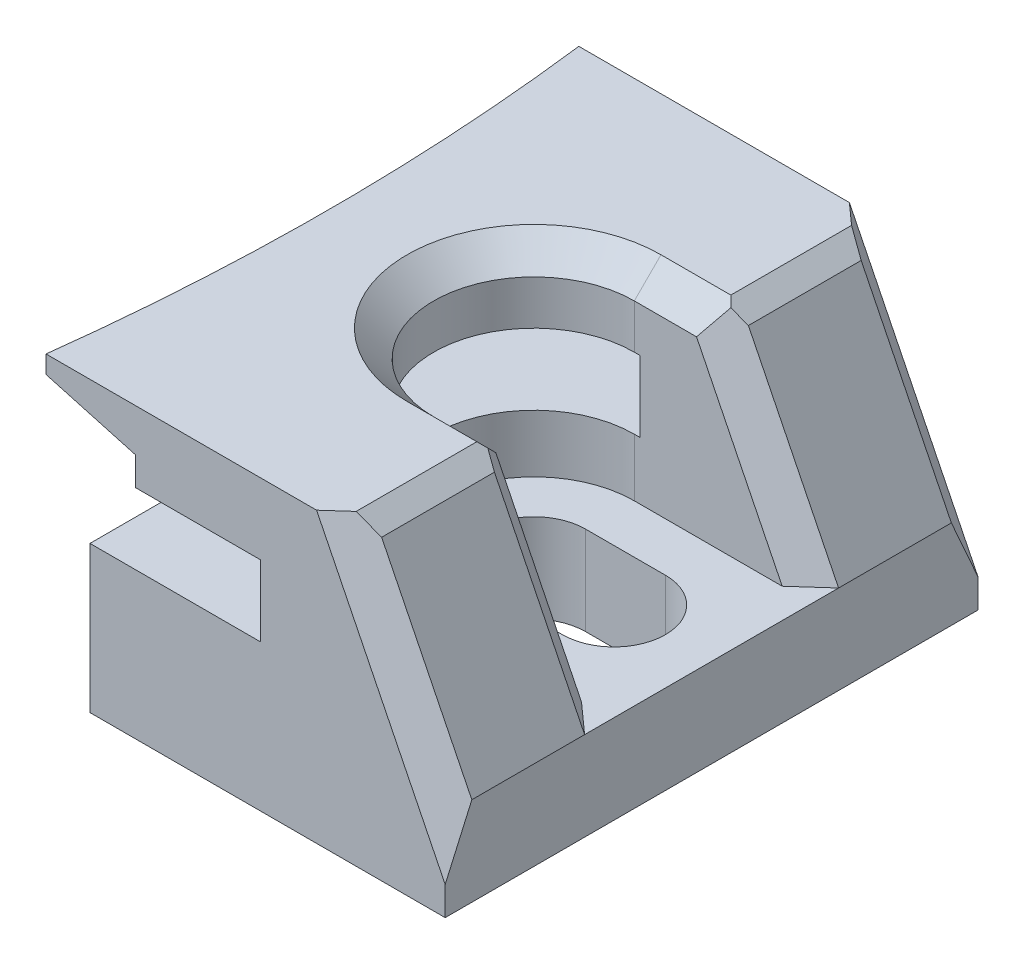
ISO-10303-21;
HEADER;
FILE_DESCRIPTION(('STEP AP214'),'2;1');
FILE_NAME('part.step','',(''),(''),'','','');
FILE_SCHEMA(('AUTOMOTIVE_DESIGN { 1 0 10303 214 1 1 1 1 }'));
ENDSEC;
DATA;
#1=APPLICATION_CONTEXT('core data for automotive mechanical design processes');
#2=APPLICATION_PROTOCOL_DEFINITION('international standard','automotive_design',2000,#1);
#3=PRODUCT_CONTEXT('',#1,'mechanical');
#4=PRODUCT('Part','Part','',(#3));
#5=PRODUCT_RELATED_PRODUCT_CATEGORY('part','',(#4));
#6=PRODUCT_DEFINITION_FORMATION('','',#4);
#7=PRODUCT_DEFINITION_CONTEXT('part definition',#1,'design');
#8=PRODUCT_DEFINITION('design','',#6,#7);
#9=PRODUCT_DEFINITION_SHAPE('','',#8);
#10=(LENGTH_UNIT() NAMED_UNIT(*) SI_UNIT(.MILLI.,.METRE.));
#11=(NAMED_UNIT(*) PLANE_ANGLE_UNIT() SI_UNIT($,.RADIAN.));
#12=(NAMED_UNIT(*) SI_UNIT($,.STERADIAN.) SOLID_ANGLE_UNIT());
#13=UNCERTAINTY_MEASURE_WITH_UNIT(LENGTH_MEASURE(1.E-05),#10,'distance_accuracy_value','');
#14=(GEOMETRIC_REPRESENTATION_CONTEXT(3) GLOBAL_UNCERTAINTY_ASSIGNED_CONTEXT((#13)) GLOBAL_UNIT_ASSIGNED_CONTEXT((#10,
#11,#12)) REPRESENTATION_CONTEXT('',''));
#15=CARTESIAN_POINT('',(0.,0.,0.));
#16=DIRECTION('',(0.,0.,1.));
#17=DIRECTION('',(1.,0.,0.));
#18=AXIS2_PLACEMENT_3D('',#15,#16,#17);
#19=CARTESIAN_POINT('',(0.,16.25,-15.));
#20=DIRECTION('',(0.,1.,0.));
#21=DIRECTION('',(0.,0.,1.));
#22=AXIS2_PLACEMENT_3D('',#19,#20,#21);
#23=PLANE('',#22);
#24=DIRECTION('',(0.74467699764755,0.,-0.667425028879371));
#25=VECTOR('',#24,1.);
#26=CARTESIAN_POINT('',(20.5941318379855,16.25,7.97782612680631));
#27=LINE('',#26,#25);
#28=CARTESIAN_POINT('',(12.7591674141475,16.25,15.));
#29=VERTEX_POINT('',#28);
#30=CARTESIAN_POINT('',(13.9327868442531,16.25,13.9481305525669));
#31=VERTEX_POINT('',#30);
#32=EDGE_CURVE('E508',#29,#31,#27,.T.);
#33=ORIENTED_EDGE('',*,*,#32,.T.);
#34=DIRECTION('',(0.,0.,-1.));
#35=VECTOR('',#34,1.);
#36=CARTESIAN_POINT('',(13.9327868442531,16.25,7.15));
#37=LINE('',#36,#35);
#38=CARTESIAN_POINT('',(13.9327868442531,16.25,7.14999999999998));
#39=VERTEX_POINT('',#38);
#40=EDGE_CURVE('E443',#31,#39,#37,.T.);
#41=ORIENTED_EDGE('',*,*,#40,.T.);
#42=DIRECTION('',(-1.,0.,0.));
#43=VECTOR('',#42,1.);
#44=CARTESIAN_POINT('',(0.,16.25,7.14999999999998));
#45=LINE('',#44,#43);
#46=CARTESIAN_POINT('',(10.,16.25,7.14999999999998));
#47=VERTEX_POINT('',#46);
#48=EDGE_CURVE('E467',#39,#47,#45,.T.);
#49=ORIENTED_EDGE('',*,*,#48,.T.);
#50=CARTESIAN_POINT('',(10.,16.25,0.));
#51=DIRECTION('',(0.,1.,0.));
#52=DIRECTION('',(0.,0.,1.));
#53=AXIS2_PLACEMENT_3D('',#50,#51,#52);
#54=CIRCLE('',#53,7.14999999999998);
#55=CARTESIAN_POINT('',(10.,16.25,-7.14999999999998));
#56=VERTEX_POINT('',#55);
#57=EDGE_CURVE('E466',#47,#56,#54,.F.);
#58=ORIENTED_EDGE('',*,*,#57,.T.);
#59=DIRECTION('',(1.,0.,0.));
#60=VECTOR('',#59,1.);
#61=CARTESIAN_POINT('',(0.,16.25,-7.14999999999998));
#62=LINE('',#61,#60);
#63=CARTESIAN_POINT('',(13.9327868442531,16.25,-7.14999999999998));
#64=VERTEX_POINT('',#63);
#65=EDGE_CURVE('E459',#56,#64,#62,.T.);
#66=ORIENTED_EDGE('',*,*,#65,.T.);
#67=DIRECTION('',(0.,0.,-1.));
#68=VECTOR('',#67,1.);
#69=CARTESIAN_POINT('',(13.9327868442531,16.25,-13.5));
#70=LINE('',#69,#68);
#71=CARTESIAN_POINT('',(13.9327868442531,16.25,-13.9481305525669));
#72=VERTEX_POINT('',#71);
#73=EDGE_CURVE('E451',#64,#72,#70,.T.);
#74=ORIENTED_EDGE('',*,*,#73,.T.);
#75=DIRECTION('',(0.744676997647548,0.,0.667425028879375));
#76=VECTOR('',#75,1.);
#77=CARTESIAN_POINT('',(5.68364983816396,16.25,-21.3415112020452));
#78=LINE('',#77,#76);
#79=CARTESIAN_POINT('',(12.7591674141475,16.25,-15.));
#80=VERTEX_POINT('',#79);
#81=EDGE_CURVE('E506',#72,#80,#78,.F.);
#82=ORIENTED_EDGE('',*,*,#81,.T.);
#83=DIRECTION('',(-1.,0.,0.));
#84=VECTOR('',#83,1.);
#85=CARTESIAN_POINT('',(0.,16.25,-15.));
#86=LINE('',#85,#84);
#87=CARTESIAN_POINT('',(-2.47564268186265,16.25,-15.));
#88=VERTEX_POINT('',#87);
#89=EDGE_CURVE('E544',#80,#88,#86,.T.);
#90=ORIENTED_EDGE('',*,*,#89,.T.);
#91=CARTESIAN_POINT('',(-123.55,16.25,0.));
#92=DIRECTION('',(0.,-1.,0.));
#93=DIRECTION('',(0.,0.,-1.));
#94=AXIS2_PLACEMENT_3D('',#91,#92,#93);
#95=CIRCLE('',#94,122.);
#96=CARTESIAN_POINT('',(-2.47564268186265,16.25,15.));
#97=VERTEX_POINT('',#96);
#98=EDGE_CURVE('E308',#88,#97,#95,.T.);
#99=ORIENTED_EDGE('',*,*,#98,.T.);
#100=DIRECTION('',(-1.,0.,0.));
#101=VECTOR('',#100,1.);
#102=CARTESIAN_POINT('',(0.,16.25,15.));
#103=LINE('',#102,#101);
#104=EDGE_CURVE('E537',#29,#97,#103,.T.);
#105=ORIENTED_EDGE('',*,*,#104,.F.);
#106=EDGE_LOOP('',(#33,#41,#49,#58,#66,#74,#82,#90,#99,#105));
#107=FACE_BOUND('',#106,.T.);
#108=ADVANCED_FACE('F34',(#107),#23,.T.);
#109=CARTESIAN_POINT('',(18.053258517141,8.93389673962023,-15.));
#110=DIRECTION('',(-0.896261105133883,-0.443526810265389,0.));
#111=DIRECTION('',(0.443526810265389,-0.896261105133883,0.));
#112=AXIS2_PLACEMENT_3D('',#109,#110,#111);
#113=PLANE('',#112);
#114=DIRECTION('',(-0.443526810265389,0.896261105133883,0.));
#115=VECTOR('',#114,1.);
#116=CARTESIAN_POINT('',(14.4327868442531,16.25,7.15));
#117=LINE('',#116,#115);
#118=CARTESIAN_POINT('',(20.,5.,7.15));
#119=VERTEX_POINT('',#118);
#120=CARTESIAN_POINT('',(14.9226180932799,15.2601687509732,7.15));
#121=VERTEX_POINT('',#120);
#122=EDGE_CURVE('E503',#119,#121,#117,.T.);
#123=ORIENTED_EDGE('',*,*,#122,.T.);
#124=DIRECTION('',(0.,0.,1.));
#125=VECTOR('',#124,1.);
#126=CARTESIAN_POINT('',(14.9226180932799,15.2601687509732,13.5));
#127=LINE('',#126,#125);
#128=CARTESIAN_POINT('',(14.9226180932799,15.2601687509732,13.5));
#129=VERTEX_POINT('',#128);
#130=EDGE_CURVE('E471',#121,#129,#127,.T.);
#131=ORIENTED_EDGE('',*,*,#130,.T.);
#132=DIRECTION('',(0.443526810265389,-0.896261105133883,0.));
#133=VECTOR('',#132,1.);
#134=CARTESIAN_POINT('',(20.,5.,13.5));
#135=LINE('',#134,#133);
#136=CARTESIAN_POINT('',(20.,5.,13.5));
#137=VERTEX_POINT('',#136);
#138=EDGE_CURVE('E501',#129,#137,#135,.T.);
#139=ORIENTED_EDGE('',*,*,#138,.T.);
#140=DIRECTION('',(0.,0.,1.));
#141=VECTOR('',#140,1.);
#142=CARTESIAN_POINT('',(20.,5.,-15.));
#143=LINE('',#142,#141);
#144=EDGE_CURVE('E558',#119,#137,#143,.T.);
#145=ORIENTED_EDGE('',*,*,#144,.F.);
#146=EDGE_LOOP('',(#123,#131,#139,#145));
#147=FACE_BOUND('',#146,.T.);
#148=ADVANCED_FACE('F391',(#147),#113,.F.);
#149=DIRECTION('',(-0.443526810265389,0.896261105133883,0.));
#150=VECTOR('',#149,1.);
#151=CARTESIAN_POINT('',(18.053258517141,8.93389673962023,-13.5));
#152=LINE('',#151,#150);
#153=CARTESIAN_POINT('',(20.,5.,-13.5));
#154=VERTEX_POINT('',#153);
#155=CARTESIAN_POINT('',(14.9226180932799,15.2601687509732,-13.5));
#156=VERTEX_POINT('',#155);
#157=EDGE_CURVE('E512',#154,#156,#152,.T.);
#158=ORIENTED_EDGE('',*,*,#157,.T.);
#159=DIRECTION('',(0.,0.,1.));
#160=VECTOR('',#159,1.);
#161=CARTESIAN_POINT('',(14.9226180932799,15.2601687509732,-7.15));
#162=LINE('',#161,#160);
#163=CARTESIAN_POINT('',(14.9226180932798,15.2601687509733,-7.14999999999999));
#164=VERTEX_POINT('',#163);
#165=EDGE_CURVE('E449',#156,#164,#162,.T.);
#166=ORIENTED_EDGE('',*,*,#165,.T.);
#167=DIRECTION('',(0.443526810265389,-0.896261105133883,0.));
#168=VECTOR('',#167,1.);
#169=CARTESIAN_POINT('',(20.,5.00000000000001,-7.15));
#170=LINE('',#169,#168);
#171=CARTESIAN_POINT('',(20.,5.,-7.15));
#172=VERTEX_POINT('',#171);
#173=EDGE_CURVE('E515',#164,#172,#170,.T.);
#174=ORIENTED_EDGE('',*,*,#173,.T.);
#175=EDGE_CURVE('E565',#154,#172,#143,.T.);
#176=ORIENTED_EDGE('',*,*,#175,.F.);
#177=EDGE_LOOP('',(#158,#166,#174,#176));
#178=FACE_BOUND('',#177,.T.);
#179=ADVANCED_FACE('F377',(#178),#113,.F.);
#180=CARTESIAN_POINT('',(-123.55,0.,0.));
#181=DIRECTION('',(0.,-1.,0.));
#182=DIRECTION('',(0.,0.,-1.));
#183=AXIS2_PLACEMENT_3D('',#180,#181,#182);
#184=CYLINDRICAL_SURFACE('',#183,134.);
#185=CARTESIAN_POINT('',(-123.55,12.25,0.));
#186=DIRECTION('',(0.,-1.,0.));
#187=DIRECTION('',(0.,0.,-1.));
#188=AXIS2_PLACEMENT_3D('',#185,#186,#187);
#189=CIRCLE('',#188,134.);
#190=CARTESIAN_POINT('',(10.330833206251,12.25,5.65));
#191=VERTEX_POINT('',#190);
#192=CARTESIAN_POINT('',(9.60780112332886,12.25,15.));
#193=VERTEX_POINT('',#192);
#194=EDGE_CURVE('E320',#191,#193,#189,.T.);
#195=ORIENTED_EDGE('',*,*,#194,.F.);
#196=DIRECTION('',(0.,-1.,0.));
#197=VECTOR('',#196,1.);
#198=CARTESIAN_POINT('',(10.330833206251,0.,5.65));
#199=LINE('',#198,#197);
#200=CARTESIAN_POINT('',(10.330833206251,8.25,5.65));
#201=VERTEX_POINT('',#200);
#202=EDGE_CURVE('E298',#191,#201,#199,.T.);
#203=ORIENTED_EDGE('',*,*,#202,.T.);
#204=CARTESIAN_POINT('',(-123.55,8.25,0.));
#205=DIRECTION('',(0.,-1.,0.));
#206=DIRECTION('',(0.,0.,-1.));
#207=AXIS2_PLACEMENT_3D('',#204,#205,#206);
#208=CIRCLE('',#207,134.);
#209=CARTESIAN_POINT('',(9.60780112332886,8.25,15.));
#210=VERTEX_POINT('',#209);
#211=EDGE_CURVE('E304',#201,#210,#208,.T.);
#212=ORIENTED_EDGE('',*,*,#211,.T.);
#213=DIRECTION('',(0.,-1.,0.));
#214=VECTOR('',#213,1.);
#215=CARTESIAN_POINT('',(9.60780112332886,0.,15.));
#216=LINE('',#215,#214);
#217=EDGE_CURVE('E571',#193,#210,#216,.T.);
#218=ORIENTED_EDGE('',*,*,#217,.F.);
#219=EDGE_LOOP('',(#195,#203,#212,#218));
#220=FACE_BOUND('',#219,.T.);
#221=ADVANCED_FACE('F374',(#220),#184,.F.);
#222=CARTESIAN_POINT('',(9.60780112332886,8.25,-15.));
#223=VERTEX_POINT('',#222);
#224=CARTESIAN_POINT('',(10.330833206251,8.25,-5.65));
#225=VERTEX_POINT('',#224);
#226=EDGE_CURVE('E305',#223,#225,#208,.T.);
#227=ORIENTED_EDGE('',*,*,#226,.T.);
#228=DIRECTION('',(0.,-1.,0.));
#229=VECTOR('',#228,1.);
#230=CARTESIAN_POINT('',(10.330833206251,0.,-5.65));
#231=LINE('',#230,#229);
#232=CARTESIAN_POINT('',(10.330833206251,12.25,-5.65));
#233=VERTEX_POINT('',#232);
#234=EDGE_CURVE('E292',#225,#233,#231,.F.);
#235=ORIENTED_EDGE('',*,*,#234,.T.);
#236=CARTESIAN_POINT('',(9.60780112332886,12.25,-15.));
#237=VERTEX_POINT('',#236);
#238=EDGE_CURVE('E321',#237,#233,#189,.T.);
#239=ORIENTED_EDGE('',*,*,#238,.F.);
#240=DIRECTION('',(0.,-1.,0.));
#241=VECTOR('',#240,1.);
#242=CARTESIAN_POINT('',(9.60780112332886,0.,-15.));
#243=LINE('',#242,#241);
#244=EDGE_CURVE('E583',#237,#223,#243,.T.);
#245=ORIENTED_EDGE('',*,*,#244,.T.);
#246=EDGE_LOOP('',(#227,#235,#239,#245));
#247=FACE_BOUND('',#246,.T.);
#248=ADVANCED_FACE('F376',(#247),#184,.F.);
#249=CARTESIAN_POINT('',(0.,12.25,0.));
#250=DIRECTION('',(0.,-1.,0.));
#251=DIRECTION('',(0.,0.,-1.));
#252=AXIS2_PLACEMENT_3D('',#249,#250,#251);
#253=PLANE('',#252);
#254=CARTESIAN_POINT('',(10.,12.25,0.));
#255=DIRECTION('',(0.,-1.,0.));
#256=DIRECTION('',(0.,0.,-1.));
#257=AXIS2_PLACEMENT_3D('',#254,#255,#256);
#258=CIRCLE('',#257,5.65);
#259=CARTESIAN_POINT('',(10.,12.25,5.65));
#260=VERTEX_POINT('',#259);
#261=CARTESIAN_POINT('',(10.,12.25,-5.65));
#262=VERTEX_POINT('',#261);
#263=EDGE_CURVE('E286',#260,#262,#258,.T.);
#264=ORIENTED_EDGE('',*,*,#263,.F.);
#265=DIRECTION('',(1.,0.,0.));
#266=VECTOR('',#265,1.);
#267=CARTESIAN_POINT('',(0.,12.25,5.65));
#268=LINE('',#267,#266);
#269=EDGE_CURVE('E301',#260,#191,#268,.T.);
#270=ORIENTED_EDGE('',*,*,#269,.T.);
#271=ORIENTED_EDGE('',*,*,#194,.T.);
#272=DIRECTION('',(1.,0.,0.));
#273=VECTOR('',#272,1.);
#274=CARTESIAN_POINT('',(0.,12.25,15.));
#275=LINE('',#274,#273);
#276=CARTESIAN_POINT('',(2.56106216347556,12.25,15.));
#277=VERTEX_POINT('',#276);
#278=EDGE_CURVE('E573',#277,#193,#275,.T.);
#279=ORIENTED_EDGE('',*,*,#278,.F.);
#280=CARTESIAN_POINT('',(-123.55,12.25,0.));
#281=DIRECTION('',(0.,-1.,0.));
#282=DIRECTION('',(0.,0.,-1.));
#283=AXIS2_PLACEMENT_3D('',#280,#281,#282);
#284=CIRCLE('',#283,127.);
#285=CARTESIAN_POINT('',(2.56106216347556,12.25,-15.));
#286=VERTEX_POINT('',#285);
#287=EDGE_CURVE('E317',#286,#277,#284,.T.);
#288=ORIENTED_EDGE('',*,*,#287,.F.);
#289=DIRECTION('',(1.,0.,0.));
#290=VECTOR('',#289,1.);
#291=CARTESIAN_POINT('',(0.,12.25,-15.));
#292=LINE('',#291,#290);
#293=EDGE_CURVE('E582',#286,#237,#292,.T.);
#294=ORIENTED_EDGE('',*,*,#293,.T.);
#295=ORIENTED_EDGE('',*,*,#238,.T.);
#296=DIRECTION('',(-1.,0.,0.));
#297=VECTOR('',#296,1.);
#298=CARTESIAN_POINT('',(0.,12.25,-5.65));
#299=LINE('',#298,#297);
#300=EDGE_CURVE('E295',#233,#262,#299,.T.);
#301=ORIENTED_EDGE('',*,*,#300,.T.);
#302=EDGE_LOOP('',(#264,#270,#271,#279,#288,#294,#295,#301));
#303=FACE_BOUND('',#302,.T.);
#304=ADVANCED_FACE('F379',(#303),#253,.T.);
#305=CARTESIAN_POINT('',(0.,8.25,0.));
#306=DIRECTION('',(0.,-1.,0.));
#307=DIRECTION('',(0.,0.,-1.));
#308=AXIS2_PLACEMENT_3D('',#305,#306,#307);
#309=PLANE('',#308);
#310=DIRECTION('',(1.,0.,0.));
#311=VECTOR('',#310,1.);
#312=CARTESIAN_POINT('',(0.,8.25,5.65));
#313=LINE('',#312,#311);
#314=CARTESIAN_POINT('',(10.,8.25,5.65));
#315=VERTEX_POINT('',#314);
#316=EDGE_CURVE('E524',#315,#201,#313,.T.);
#317=ORIENTED_EDGE('',*,*,#316,.F.);
#318=CARTESIAN_POINT('',(10.,8.25,0.));
#319=DIRECTION('',(0.,-1.,0.));
#320=DIRECTION('',(0.,0.,-1.));
#321=AXIS2_PLACEMENT_3D('',#318,#319,#320);
#322=CIRCLE('',#321,5.65);
#323=CARTESIAN_POINT('',(10.,8.25,-5.65));
#324=VERTEX_POINT('',#323);
#325=EDGE_CURVE('E528',#315,#324,#322,.T.);
#326=ORIENTED_EDGE('',*,*,#325,.T.);
#327=DIRECTION('',(-1.,0.,0.));
#328=VECTOR('',#327,1.);
#329=CARTESIAN_POINT('',(0.,8.25,-5.65));
#330=LINE('',#329,#328);
#331=EDGE_CURVE('E526',#225,#324,#330,.T.);
#332=ORIENTED_EDGE('',*,*,#331,.F.);
#333=ORIENTED_EDGE('',*,*,#226,.F.);
#334=DIRECTION('',(1.,0.,0.));
#335=VECTOR('',#334,1.);
#336=CARTESIAN_POINT('',(0.,8.25,-15.));
#337=LINE('',#336,#335);
#338=CARTESIAN_POINT('',(0.,8.25,-15.));
#339=VERTEX_POINT('',#338);
#340=EDGE_CURVE('E327',#339,#223,#337,.T.);
#341=ORIENTED_EDGE('',*,*,#340,.F.);
#342=DIRECTION('',(0.,0.,-1.));
#343=VECTOR('',#342,1.);
#344=CARTESIAN_POINT('',(0.,8.25,-15.));
#345=LINE('',#344,#343);
#346=CARTESIAN_POINT('',(0.,8.25,15.));
#347=VERTEX_POINT('',#346);
#348=EDGE_CURVE('E324',#347,#339,#345,.T.);
#349=ORIENTED_EDGE('',*,*,#348,.F.);
#350=DIRECTION('',(1.,0.,0.));
#351=VECTOR('',#350,1.);
#352=CARTESIAN_POINT('',(0.,8.25,15.));
#353=LINE('',#352,#351);
#354=EDGE_CURVE('E562',#347,#210,#353,.T.);
#355=ORIENTED_EDGE('',*,*,#354,.T.);
#356=ORIENTED_EDGE('',*,*,#211,.F.);
#357=EDGE_LOOP('',(#317,#326,#332,#333,#341,#349,#355,#356));
#358=FACE_BOUND('',#357,.T.);
#359=ADVANCED_FACE('F381',(#358),#309,.F.);
#360=CARTESIAN_POINT('',(0.,0.,-15.));
#361=DIRECTION('',(0.,0.,1.));
#362=DIRECTION('',(1.,0.,0.));
#363=AXIS2_PLACEMENT_3D('',#360,#361,#362);
#364=PLANE('',#363);
#365=ORIENTED_EDGE('',*,*,#89,.F.);
#366=DIRECTION('',(0.443526810265389,-0.896261105133883,0.));
#367=VECTOR('',#366,1.);
#368=CARTESIAN_POINT('',(16.7088668594402,8.26860652422214,-15.));
#369=LINE('',#368,#367);
#370=CARTESIAN_POINT('',(20.,1.61801729843013,-15.));
#371=VERTEX_POINT('',#370);
#372=EDGE_CURVE('E521',#80,#371,#369,.T.);
#373=ORIENTED_EDGE('',*,*,#372,.T.);
#374=DIRECTION('',(0.,-1.,0.));
#375=VECTOR('',#374,1.);
#376=CARTESIAN_POINT('',(20.,0.,-15.));
#377=LINE('',#376,#375);
#378=CARTESIAN_POINT('',(20.,0.,-15.));
#379=VERTEX_POINT('',#378);
#380=EDGE_CURVE('E548',#371,#379,#377,.T.);
#381=ORIENTED_EDGE('',*,*,#380,.T.);
#382=DIRECTION('',(-1.,0.,0.));
#383=VECTOR('',#382,1.);
#384=CARTESIAN_POINT('',(0.,0.,-15.));
#385=LINE('',#384,#383);
#386=CARTESIAN_POINT('',(0.,0.,-15.));
#387=VERTEX_POINT('',#386);
#388=EDGE_CURVE('E551',#379,#387,#385,.T.);
#389=ORIENTED_EDGE('',*,*,#388,.T.);
#390=DIRECTION('',(0.,1.,0.));
#391=VECTOR('',#390,1.);
#392=CARTESIAN_POINT('',(0.,0.,-15.));
#393=LINE('',#392,#391);
#394=EDGE_CURVE('E547',#387,#339,#393,.T.);
#395=ORIENTED_EDGE('',*,*,#394,.T.);
#396=ORIENTED_EDGE('',*,*,#340,.T.);
#397=ORIENTED_EDGE('',*,*,#244,.F.);
#398=ORIENTED_EDGE('',*,*,#293,.F.);
#399=DIRECTION('',(0.,-1.,0.));
#400=VECTOR('',#399,1.);
#401=CARTESIAN_POINT('',(2.56106216347558,0.,-15.));
#402=LINE('',#401,#400);
#403=CARTESIAN_POINT('',(2.56106216347558,13.85,-15.));
#404=VERTEX_POINT('',#403);
#405=EDGE_CURVE('E339',#404,#286,#402,.T.);
#406=ORIENTED_EDGE('',*,*,#405,.F.);
#407=CARTESIAN_POINT('',(-17.2503522939155,19.35122717024,-15.));
#408=CARTESIAN_POINT('',(-14.6728640274886,18.6366024557879,-15.));
#409=CARTESIAN_POINT('',(-12.0955023897701,17.9215212079282,-15.));
#410=CARTESIAN_POINT('',(-6.94099288870878,16.4905892491619,-15.));
#411=CARTESIAN_POINT('',(-4.36384502535253,15.7747385383033,-15.));
#412=CARTESIAN_POINT('',(0.79027667669653,14.3424111833684,-15.));
#413=CARTESIAN_POINT('',(3.36725051539305,13.6259345393053,-15.));
#414=CARTESIAN_POINT('',(8.52105158713077,12.1924535259276,-15.));
#415=CARTESIAN_POINT('',(11.0978788201628,11.4754491565803,-15.));
#416=CARTESIAN_POINT('',(13.674646272308,10.7582300807129,-15.));
#417=B_SPLINE_CURVE_WITH_KNOTS('',3,(#407,#408,#409,#410,#411,#412,#413,#414,#415,#416),
.UNSPECIFIED.,.F.,.F.,(4,2,2,2,4),(0.,8.0241639059122,16.0483273113437,24.0724905460078,
32.096654279301),.UNSPECIFIED.);
#418=CARTESIAN_POINT('',(-2.47564268186266,15.25,-15.));
#419=VERTEX_POINT('',#418);
#420=EDGE_CURVE('E332',#419,#404,#417,.T.);
#421=ORIENTED_EDGE('',*,*,#420,.F.);
#422=DIRECTION('',(0.,-1.,0.));
#423=VECTOR('',#422,1.);
#424=CARTESIAN_POINT('',(-2.47564268186265,0.,-15.));
#425=LINE('',#424,#423);
#426=EDGE_CURVE('E330',#88,#419,#425,.T.);
#427=ORIENTED_EDGE('',*,*,#426,.F.);
#428=EDGE_LOOP('',(#365,#373,#381,#389,#395,#396,#397,#398,#406,#421,#427));
#429=FACE_BOUND('',#428,.T.);
#430=ADVANCED_FACE('F341',(#429),#364,.F.);
#431=CARTESIAN_POINT('',(0.,0.,15.));
#432=DIRECTION('',(0.,0.,1.));
#433=DIRECTION('',(1.,0.,0.));
#434=AXIS2_PLACEMENT_3D('',#431,#432,#433);
#435=PLANE('',#434);
#436=DIRECTION('',(0.,-1.,0.));
#437=VECTOR('',#436,1.);
#438=CARTESIAN_POINT('',(20.,0.,15.));
#439=LINE('',#438,#437);
#440=CARTESIAN_POINT('',(20.,1.61801729843014,15.));
#441=VERTEX_POINT('',#440);
#442=CARTESIAN_POINT('',(20.,0.,15.));
#443=VERTEX_POINT('',#442);
#444=EDGE_CURVE('E585',#441,#443,#439,.T.);
#445=ORIENTED_EDGE('',*,*,#444,.F.);
#446=DIRECTION('',(-0.443526810265389,0.896261105133883,0.));
#447=VECTOR('',#446,1.);
#448=CARTESIAN_POINT('',(13.0883951865523,15.5847097846019,15.));
#449=LINE('',#448,#447);
#450=EDGE_CURVE('E499',#441,#29,#449,.T.);
#451=ORIENTED_EDGE('',*,*,#450,.T.);
#452=ORIENTED_EDGE('',*,*,#104,.T.);
#453=DIRECTION('',(0.,-1.,0.));
#454=VECTOR('',#453,1.);
#455=CARTESIAN_POINT('',(-2.47564268186265,0.,15.));
#456=LINE('',#455,#454);
#457=CARTESIAN_POINT('',(-2.47564268186266,15.25,15.));
#458=VERTEX_POINT('',#457);
#459=EDGE_CURVE('E364',#97,#458,#456,.T.);
#460=ORIENTED_EDGE('',*,*,#459,.T.);
#461=CARTESIAN_POINT('',(-17.2503522939155,19.35122717024,15.));
#462=CARTESIAN_POINT('',(-14.6728640274886,18.6366024557879,15.));
#463=CARTESIAN_POINT('',(-12.0955023897701,17.9215212079282,15.));
#464=CARTESIAN_POINT('',(-6.94099288870878,16.4905892491619,15.));
#465=CARTESIAN_POINT('',(-4.36384502535253,15.7747385383033,15.));
#466=CARTESIAN_POINT('',(0.79027667669653,14.3424111833684,15.));
#467=CARTESIAN_POINT('',(3.36725051539305,13.6259345393053,15.));
#468=CARTESIAN_POINT('',(8.52105158713077,12.1924535259276,15.));
#469=CARTESIAN_POINT('',(11.0978788201628,11.4754491565803,15.));
#470=CARTESIAN_POINT('',(13.674646272308,10.7582300807129,15.));
#471=B_SPLINE_CURVE_WITH_KNOTS('',3,(#461,#462,#463,#464,#465,#466,#467,#468,#469,#470),
.UNSPECIFIED.,.F.,.F.,(4,2,2,2,4),(0.,8.0241639059122,16.0483273113437,24.0724905460078,
32.096654279301),.UNSPECIFIED.);
#472=CARTESIAN_POINT('',(2.56106216347558,13.85,15.));
#473=VERTEX_POINT('',#472);
#474=EDGE_CURVE('E357',#458,#473,#471,.T.);
#475=ORIENTED_EDGE('',*,*,#474,.T.);
#476=DIRECTION('',(0.,-1.,0.));
#477=VECTOR('',#476,1.);
#478=CARTESIAN_POINT('',(2.56106216347558,0.,15.));
#479=LINE('',#478,#477);
#480=EDGE_CURVE('E365',#473,#277,#479,.T.);
#481=ORIENTED_EDGE('',*,*,#480,.T.);
#482=ORIENTED_EDGE('',*,*,#278,.T.);
#483=ORIENTED_EDGE('',*,*,#217,.T.);
#484=ORIENTED_EDGE('',*,*,#354,.F.);
#485=DIRECTION('',(0.,1.,0.));
#486=VECTOR('',#485,1.);
#487=CARTESIAN_POINT('',(0.,0.,15.));
#488=LINE('',#487,#486);
#489=CARTESIAN_POINT('',(0.,0.,15.));
#490=VERTEX_POINT('',#489);
#491=EDGE_CURVE('E590',#490,#347,#488,.T.);
#492=ORIENTED_EDGE('',*,*,#491,.F.);
#493=DIRECTION('',(-1.,0.,0.));
#494=VECTOR('',#493,1.);
#495=CARTESIAN_POINT('',(0.,0.,15.));
#496=LINE('',#495,#494);
#497=EDGE_CURVE('E553',#443,#490,#496,.T.);
#498=ORIENTED_EDGE('',*,*,#497,.F.);
#499=EDGE_LOOP('',(#445,#451,#452,#460,#475,#481,#482,#483,#484,#492,#498));
#500=FACE_BOUND('',#499,.T.);
#501=ADVANCED_FACE('F368',(#500),#435,.T.);
#502=CARTESIAN_POINT('',(20.,0.,-15.));
#503=DIRECTION('',(-1.,0.,0.));
#504=DIRECTION('',(0.,0.,1.));
#505=AXIS2_PLACEMENT_3D('',#502,#503,#504);
#506=PLANE('',#505);
#507=ORIENTED_EDGE('',*,*,#380,.F.);
#508=DIRECTION('',(0.,-0.914122598557605,-0.405437880329764));
#509=VECTOR('',#508,1.);
#510=CARTESIAN_POINT('',(20.,7.17538349989837,-12.5351590951861));
#511=LINE('',#510,#509);
#512=EDGE_CURVE('E517',#371,#154,#511,.F.);
#513=ORIENTED_EDGE('',*,*,#512,.T.);
#514=ORIENTED_EDGE('',*,*,#175,.T.);
#515=EDGE_CURVE('E568',#172,#119,#143,.T.);
#516=ORIENTED_EDGE('',*,*,#515,.T.);
#517=ORIENTED_EDGE('',*,*,#144,.T.);
#518=DIRECTION('',(0.,-0.914122598557606,0.405437880329761));
#519=VECTOR('',#518,1.);
#520=CARTESIAN_POINT('',(20.,8.28724328606058,12.0420194707673));
#521=LINE('',#520,#519);
#522=EDGE_CURVE('E519',#137,#441,#521,.T.);
#523=ORIENTED_EDGE('',*,*,#522,.T.);
#524=ORIENTED_EDGE('',*,*,#444,.T.);
#525=DIRECTION('',(0.,0.,1.));
#526=VECTOR('',#525,1.);
#527=CARTESIAN_POINT('',(20.,0.,-15.));
#528=LINE('',#527,#526);
#529=EDGE_CURVE('E559',#379,#443,#528,.T.);
#530=ORIENTED_EDGE('',*,*,#529,.F.);
#531=EDGE_LOOP('',(#507,#513,#514,#516,#517,#523,#524,#530));
#532=FACE_BOUND('',#531,.T.);
#533=ADVANCED_FACE('F372',(#532),#506,.F.);
#534=CARTESIAN_POINT('',(0.,0.,-15.));
#535=DIRECTION('',(0.,1.,0.));
#536=DIRECTION('',(-1.,0.,0.));
#537=AXIS2_PLACEMENT_3D('',#534,#535,#536);
#538=PLANE('',#537);
#539=DIRECTION('',(1.,0.,0.));
#540=VECTOR('',#539,1.);
#541=CARTESIAN_POINT('',(10.,0.,-2.9));
#542=LINE('',#541,#540);
#543=CARTESIAN_POINT('',(10.,0.,-2.9));
#544=VERTEX_POINT('',#543);
#545=CARTESIAN_POINT('',(14.5,0.,-2.9));
#546=VERTEX_POINT('',#545);
#547=EDGE_CURVE('E668',#544,#546,#542,.T.);
#548=ORIENTED_EDGE('',*,*,#547,.F.);
#549=CARTESIAN_POINT('',(10.,0.,0.));
#550=DIRECTION('',(0.,1.,0.));
#551=DIRECTION('',(-1.,0.,0.));
#552=AXIS2_PLACEMENT_3D('',#549,#550,#551);
#553=CIRCLE('',#552,2.9);
#554=CARTESIAN_POINT('',(10.,0.,2.9));
#555=VERTEX_POINT('',#554);
#556=EDGE_CURVE('E275',#555,#544,#553,.F.);
#557=ORIENTED_EDGE('',*,*,#556,.F.);
#558=DIRECTION('',(-1.,0.,0.));
#559=VECTOR('',#558,1.);
#560=CARTESIAN_POINT('',(10.,0.,2.9));
#561=LINE('',#560,#559);
#562=CARTESIAN_POINT('',(14.5,0.,2.9));
#563=VERTEX_POINT('',#562);
#564=EDGE_CURVE('E272',#563,#555,#561,.T.);
#565=ORIENTED_EDGE('',*,*,#564,.F.);
#566=CARTESIAN_POINT('',(14.5,0.,0.));
#567=DIRECTION('',(0.,1.,0.));
#568=DIRECTION('',(-1.,0.,0.));
#569=AXIS2_PLACEMENT_3D('',#566,#567,#568);
#570=CIRCLE('',#569,2.9);
#571=EDGE_CURVE('E245',#546,#563,#570,.F.);
#572=ORIENTED_EDGE('',*,*,#571,.F.);
#573=EDGE_LOOP('',(#548,#557,#565,#572));
#574=FACE_BOUND('',#573,.T.);
#575=ORIENTED_EDGE('',*,*,#529,.T.);
#576=ORIENTED_EDGE('',*,*,#497,.T.);
#577=DIRECTION('',(0.,0.,1.));
#578=VECTOR('',#577,1.);
#579=CARTESIAN_POINT('',(0.,0.,-15.));
#580=LINE('',#579,#578);
#581=EDGE_CURVE('E563',#387,#490,#580,.T.);
#582=ORIENTED_EDGE('',*,*,#581,.F.);
#583=ORIENTED_EDGE('',*,*,#388,.F.);
#584=EDGE_LOOP('',(#575,#576,#582,#583));
#585=FACE_BOUND('',#584,.T.);
#586=ADVANCED_FACE('F405',(#574,#585),#538,.F.);
#587=CARTESIAN_POINT('',(0.,0.,-15.));
#588=DIRECTION('',(1.,0.,0.));
#589=DIRECTION('',(0.,0.,-1.));
#590=AXIS2_PLACEMENT_3D('',#587,#588,#589);
#591=PLANE('',#590);
#592=ORIENTED_EDGE('',*,*,#491,.T.);
#593=ORIENTED_EDGE('',*,*,#348,.T.);
#594=ORIENTED_EDGE('',*,*,#394,.F.);
#595=ORIENTED_EDGE('',*,*,#581,.T.);
#596=EDGE_LOOP('',(#592,#593,#594,#595));
#597=FACE_BOUND('',#596,.T.);
#598=ADVANCED_FACE('F401',(#597),#591,.F.);
#599=CARTESIAN_POINT('',(-123.55,0.,0.));
#600=DIRECTION('',(0.,-1.,0.));
#601=DIRECTION('',(0.,0.,-1.));
#602=AXIS2_PLACEMENT_3D('',#599,#600,#601);
#603=CYLINDRICAL_SURFACE('',#602,127.);
#604=ORIENTED_EDGE('',*,*,#405,.T.);
#605=ORIENTED_EDGE('',*,*,#287,.T.);
#606=ORIENTED_EDGE('',*,*,#480,.F.);
#607=CARTESIAN_POINT('',(-123.55,13.85,0.));
#608=DIRECTION('',(0.,-1.,0.));
#609=DIRECTION('',(0.,0.,-1.));
#610=AXIS2_PLACEMENT_3D('',#607,#608,#609);
#611=CIRCLE('',#610,127.);
#612=EDGE_CURVE('E314',#404,#473,#611,.T.);
#613=ORIENTED_EDGE('',*,*,#612,.F.);
#614=EDGE_LOOP('',(#604,#605,#606,#613));
#615=FACE_BOUND('',#614,.T.);
#616=ADVANCED_FACE('F351',(#615),#603,.F.);
#617=CARTESIAN_POINT('',(-123.55,15.25,0.));
#618=DIRECTION('',(0.,-1.,0.));
#619=DIRECTION('',(0.,0.,-1.));
#620=AXIS2_PLACEMENT_3D('',#617,#618,#619);
#621=CONICAL_SURFACE('',#620,122.,1.29778762370819);
#622=ORIENTED_EDGE('',*,*,#420,.T.);
#623=ORIENTED_EDGE('',*,*,#612,.T.);
#624=ORIENTED_EDGE('',*,*,#474,.F.);
#625=CARTESIAN_POINT('',(-123.55,15.25,0.));
#626=DIRECTION('',(0.,-1.,0.));
#627=DIRECTION('',(0.,0.,-1.));
#628=AXIS2_PLACEMENT_3D('',#625,#626,#627);
#629=CIRCLE('',#628,122.);
#630=EDGE_CURVE('E311',#419,#458,#629,.T.);
#631=ORIENTED_EDGE('',*,*,#630,.F.);
#632=EDGE_LOOP('',(#622,#623,#624,#631));
#633=FACE_BOUND('',#632,.T.);
#634=ADVANCED_FACE('F345',(#633),#621,.F.);
#635=CARTESIAN_POINT('',(-123.55,0.,0.));
#636=DIRECTION('',(0.,-1.,0.));
#637=DIRECTION('',(0.,0.,-1.));
#638=AXIS2_PLACEMENT_3D('',#635,#636,#637);
#639=CYLINDRICAL_SURFACE('',#638,122.);
#640=ORIENTED_EDGE('',*,*,#426,.T.);
#641=ORIENTED_EDGE('',*,*,#630,.T.);
#642=ORIENTED_EDGE('',*,*,#459,.F.);
#643=ORIENTED_EDGE('',*,*,#98,.F.);
#644=EDGE_LOOP('',(#640,#641,#642,#643));
#645=FACE_BOUND('',#644,.T.);
#646=ADVANCED_FACE('F350',(#645),#639,.F.);
#647=CARTESIAN_POINT('',(0.,16.25,5.65));
#648=DIRECTION('',(0.,0.,-1.));
#649=DIRECTION('',(-1.,0.,0.));
#650=AXIS2_PLACEMENT_3D('',#647,#648,#649);
#651=PLANE('',#650);
#652=DIRECTION('',(0.,-1.,0.));
#653=VECTOR('',#652,1.);
#654=CARTESIAN_POINT('',(10.,16.25,5.65));
#655=LINE('',#654,#653);
#656=CARTESIAN_POINT('',(10.,14.75,5.65));
#657=VERTEX_POINT('',#656);
#658=EDGE_CURVE('E288',#657,#260,#655,.T.);
#659=ORIENTED_EDGE('',*,*,#658,.F.);
#660=DIRECTION('',(1.,0.,0.));
#661=VECTOR('',#660,1.);
#662=CARTESIAN_POINT('',(0.,14.75,5.65));
#663=LINE('',#662,#661);
#664=CARTESIAN_POINT('',(13.5014625015804,14.75,5.65));
#665=VERTEX_POINT('',#664);
#666=EDGE_CURVE('E494',#657,#665,#663,.T.);
#667=ORIENTED_EDGE('',*,*,#666,.T.);
#668=DIRECTION('',(0.443526810265389,-0.896261105133883,0.));
#669=VECTOR('',#668,1.);
#670=CARTESIAN_POINT('',(18.6556083422992,4.33470978460192,5.65));
#671=LINE('',#670,#669);
#672=CARTESIAN_POINT('',(18.3263805698944,5.00000000000001,5.65));
#673=VERTEX_POINT('',#672);
#674=EDGE_CURVE('E497',#665,#673,#671,.T.);
#675=ORIENTED_EDGE('',*,*,#674,.T.);
#676=DIRECTION('',(1.,0.,0.));
#677=VECTOR('',#676,1.);
#678=CARTESIAN_POINT('',(0.,5.,5.65));
#679=LINE('',#678,#677);
#680=CARTESIAN_POINT('',(10.,5.00000000000001,5.65));
#681=VERTEX_POINT('',#680);
#682=EDGE_CURVE('E274',#681,#673,#679,.T.);
#683=ORIENTED_EDGE('',*,*,#682,.F.);
#684=EDGE_CURVE('E283',#315,#681,#655,.T.);
#685=ORIENTED_EDGE('',*,*,#684,.F.);
#686=ORIENTED_EDGE('',*,*,#316,.T.);
#687=ORIENTED_EDGE('',*,*,#202,.F.);
#688=ORIENTED_EDGE('',*,*,#269,.F.);
#689=EDGE_LOOP('',(#659,#667,#675,#683,#685,#686,#687,#688));
#690=FACE_BOUND('',#689,.T.);
#691=ADVANCED_FACE('F637',(#690),#651,.T.);
#692=CARTESIAN_POINT('',(0.,16.25,-5.65));
#693=DIRECTION('',(0.,0.,1.));
#694=DIRECTION('',(1.,0.,0.));
#695=AXIS2_PLACEMENT_3D('',#692,#693,#694);
#696=PLANE('',#695);
#697=DIRECTION('',(-0.443526810265389,0.896261105133883,0.));
#698=VECTOR('',#697,1.);
#699=CARTESIAN_POINT('',(13.0883951865523,15.5847097846019,-5.65));
#700=LINE('',#699,#698);
#701=CARTESIAN_POINT('',(18.3263805698944,5.00000000000001,-5.65));
#702=VERTEX_POINT('',#701);
#703=CARTESIAN_POINT('',(13.5014625015804,14.75,-5.65));
#704=VERTEX_POINT('',#703);
#705=EDGE_CURVE('E492',#702,#704,#700,.T.);
#706=ORIENTED_EDGE('',*,*,#705,.T.);
#707=DIRECTION('',(-1.,0.,0.));
#708=VECTOR('',#707,1.);
#709=CARTESIAN_POINT('',(0.,14.75,-5.65));
#710=LINE('',#709,#708);
#711=CARTESIAN_POINT('',(10.,14.75,-5.65));
#712=VERTEX_POINT('',#711);
#713=EDGE_CURVE('E490',#704,#712,#710,.T.);
#714=ORIENTED_EDGE('',*,*,#713,.T.);
#715=DIRECTION('',(0.,-1.,0.));
#716=VECTOR('',#715,1.);
#717=CARTESIAN_POINT('',(10.,16.25,-5.65));
#718=LINE('',#717,#716);
#719=EDGE_CURVE('E284',#712,#262,#718,.T.);
#720=ORIENTED_EDGE('',*,*,#719,.T.);
#721=ORIENTED_EDGE('',*,*,#300,.F.);
#722=ORIENTED_EDGE('',*,*,#234,.F.);
#723=ORIENTED_EDGE('',*,*,#331,.T.);
#724=CARTESIAN_POINT('',(10.,5.00000000000001,-5.65));
#725=VERTEX_POINT('',#724);
#726=EDGE_CURVE('E287',#324,#725,#718,.T.);
#727=ORIENTED_EDGE('',*,*,#726,.T.);
#728=DIRECTION('',(-1.,0.,0.));
#729=VECTOR('',#728,1.);
#730=CARTESIAN_POINT('',(0.,5.,-5.65));
#731=LINE('',#730,#729);
#732=EDGE_CURVE('E281',#702,#725,#731,.T.);
#733=ORIENTED_EDGE('',*,*,#732,.F.);
#734=EDGE_LOOP('',(#706,#714,#720,#721,#722,#723,#727,#733));
#735=FACE_BOUND('',#734,.T.);
#736=ADVANCED_FACE('F613',(#735),#696,.T.);
#737=CARTESIAN_POINT('',(10.,16.25,0.));
#738=DIRECTION('',(0.,-1.,0.));
#739=DIRECTION('',(1.,0.,0.));
#740=AXIS2_PLACEMENT_3D('',#737,#738,#739);
#741=CYLINDRICAL_SURFACE('',#740,5.65);
#742=ORIENTED_EDGE('',*,*,#684,.T.);
#743=CARTESIAN_POINT('',(10.,5.00000000000001,0.));
#744=DIRECTION('',(0.,-1.,0.));
#745=DIRECTION('',(1.,0.,0.));
#746=AXIS2_PLACEMENT_3D('',#743,#744,#745);
#747=CIRCLE('',#746,5.65);
#748=EDGE_CURVE('E278',#681,#725,#747,.T.);
#749=ORIENTED_EDGE('',*,*,#748,.T.);
#750=ORIENTED_EDGE('',*,*,#726,.F.);
#751=ORIENTED_EDGE('',*,*,#325,.F.);
#752=EDGE_LOOP('',(#742,#749,#750,#751));
#753=FACE_BOUND('',#752,.T.);
#754=ADVANCED_FACE('F624',(#753),#741,.F.);
#755=ORIENTED_EDGE('',*,*,#719,.F.);
#756=CARTESIAN_POINT('',(10.,14.75,0.));
#757=DIRECTION('',(0.,1.,0.));
#758=DIRECTION('',(0.,0.,1.));
#759=AXIS2_PLACEMENT_3D('',#756,#757,#758);
#760=CIRCLE('',#759,5.65);
#761=EDGE_CURVE('E488',#712,#657,#760,.T.);
#762=ORIENTED_EDGE('',*,*,#761,.T.);
#763=ORIENTED_EDGE('',*,*,#658,.T.);
#764=ORIENTED_EDGE('',*,*,#263,.T.);
#765=EDGE_LOOP('',(#755,#762,#763,#764));
#766=FACE_BOUND('',#765,.T.);
#767=ADVANCED_FACE('F617',(#766),#741,.F.);
#768=CARTESIAN_POINT('',(0.,5.,0.));
#769=DIRECTION('',(0.,-1.,0.));
#770=DIRECTION('',(1.,0.,0.));
#771=AXIS2_PLACEMENT_3D('',#768,#769,#770);
#772=PLANE('',#771);
#773=DIRECTION('',(1.,0.,0.));
#774=VECTOR('',#773,1.);
#775=CARTESIAN_POINT('',(10.,5.00000000000001,2.9));
#776=LINE('',#775,#774);
#777=CARTESIAN_POINT('',(10.,5.00000000000001,2.9));
#778=VERTEX_POINT('',#777);
#779=CARTESIAN_POINT('',(14.5,5.00000000000001,2.9));
#780=VERTEX_POINT('',#779);
#781=EDGE_CURVE('E253',#778,#780,#776,.T.);
#782=ORIENTED_EDGE('',*,*,#781,.F.);
#783=CARTESIAN_POINT('',(10.,5.00000000000001,0.));
#784=DIRECTION('',(0.,1.,0.));
#785=DIRECTION('',(-1.,0.,0.));
#786=AXIS2_PLACEMENT_3D('',#783,#784,#785);
#787=CIRCLE('',#786,2.9);
#788=CARTESIAN_POINT('',(10.,5.00000000000001,-2.9));
#789=VERTEX_POINT('',#788);
#790=EDGE_CURVE('E258',#789,#778,#787,.T.);
#791=ORIENTED_EDGE('',*,*,#790,.F.);
#792=DIRECTION('',(-1.,0.,0.));
#793=VECTOR('',#792,1.);
#794=CARTESIAN_POINT('',(10.,5.00000000000001,-2.9));
#795=LINE('',#794,#793);
#796=CARTESIAN_POINT('',(14.5,5.00000000000001,-2.9));
#797=VERTEX_POINT('',#796);
#798=EDGE_CURVE('E263',#797,#789,#795,.T.);
#799=ORIENTED_EDGE('',*,*,#798,.F.);
#800=CARTESIAN_POINT('',(14.5,5.00000000000001,0.));
#801=DIRECTION('',(0.,1.,0.));
#802=DIRECTION('',(-1.,0.,0.));
#803=AXIS2_PLACEMENT_3D('',#800,#801,#802);
#804=CIRCLE('',#803,2.9);
#805=EDGE_CURVE('E242',#780,#797,#804,.T.);
#806=ORIENTED_EDGE('',*,*,#805,.F.);
#807=EDGE_LOOP('',(#782,#791,#799,#806));
#808=FACE_BOUND('',#807,.T.);
#809=ORIENTED_EDGE('',*,*,#682,.T.);
#810=DIRECTION('',(0.744676997647548,0.,0.667425028879374));
#811=VECTOR('',#810,1.);
#812=CARTESIAN_POINT('',(5.35545850686852,5.,-5.97533294281304));
#813=LINE('',#812,#811);
#814=EDGE_CURVE('E476',#673,#119,#813,.T.);
#815=ORIENTED_EDGE('',*,*,#814,.T.);
#816=ORIENTED_EDGE('',*,*,#515,.F.);
#817=DIRECTION('',(-0.744676997647549,0.,0.667425028879373));
#818=VECTOR('',#817,1.);
#819=CARTESIAN_POINT('',(5.35545850686849,5.,5.97533294281303));
#820=LINE('',#819,#818);
#821=EDGE_CURVE('E486',#172,#702,#820,.T.);
#822=ORIENTED_EDGE('',*,*,#821,.T.);
#823=ORIENTED_EDGE('',*,*,#732,.T.);
#824=ORIENTED_EDGE('',*,*,#748,.F.);
#825=EDGE_LOOP('',(#809,#815,#816,#822,#823,#824));
#826=FACE_BOUND('',#825,.T.);
#827=ADVANCED_FACE('F260',(#808,#826),#772,.F.);
#828=CARTESIAN_POINT('',(10.,-11.8207444774007,0.));
#829=DIRECTION('',(0.,1.,0.));
#830=DIRECTION('',(-1.,0.,0.));
#831=AXIS2_PLACEMENT_3D('',#828,#829,#830);
#832=CYLINDRICAL_SURFACE('',#831,2.9);
#833=ORIENTED_EDGE('',*,*,#556,.T.);
#834=DIRECTION('',(0.,1.,0.));
#835=VECTOR('',#834,1.);
#836=CARTESIAN_POINT('',(10.,-11.8207444774007,-2.9));
#837=LINE('',#836,#835);
#838=EDGE_CURVE('E268',#544,#789,#837,.T.);
#839=ORIENTED_EDGE('',*,*,#838,.T.);
#840=ORIENTED_EDGE('',*,*,#790,.T.);
#841=DIRECTION('',(0.,1.,0.));
#842=VECTOR('',#841,1.);
#843=CARTESIAN_POINT('',(10.,-11.8207444774007,2.9));
#844=LINE('',#843,#842);
#845=EDGE_CURVE('E249',#555,#778,#844,.T.);
#846=ORIENTED_EDGE('',*,*,#845,.F.);
#847=EDGE_LOOP('',(#833,#839,#840,#846));
#848=FACE_BOUND('',#847,.T.);
#849=ADVANCED_FACE('F653',(#848),#832,.F.);
#850=CARTESIAN_POINT('',(10.,-11.8207444774007,-2.9));
#851=DIRECTION('',(0.,0.,-1.));
#852=DIRECTION('',(-1.,0.,0.));
#853=AXIS2_PLACEMENT_3D('',#850,#851,#852);
#854=PLANE('',#853);
#855=ORIENTED_EDGE('',*,*,#547,.T.);
#856=DIRECTION('',(0.,1.,0.));
#857=VECTOR('',#856,1.);
#858=CARTESIAN_POINT('',(14.5,-11.8207444774007,-2.9));
#859=LINE('',#858,#857);
#860=EDGE_CURVE('E248',#546,#797,#859,.T.);
#861=ORIENTED_EDGE('',*,*,#860,.T.);
#862=ORIENTED_EDGE('',*,*,#798,.T.);
#863=ORIENTED_EDGE('',*,*,#838,.F.);
#864=EDGE_LOOP('',(#855,#861,#862,#863));
#865=FACE_BOUND('',#864,.T.);
#866=ADVANCED_FACE('F656',(#865),#854,.F.);
#867=CARTESIAN_POINT('',(14.5,-11.8207444774007,0.));
#868=DIRECTION('',(0.,1.,0.));
#869=DIRECTION('',(-1.,0.,0.));
#870=AXIS2_PLACEMENT_3D('',#867,#868,#869);
#871=CYLINDRICAL_SURFACE('',#870,2.9);
#872=ORIENTED_EDGE('',*,*,#571,.T.);
#873=DIRECTION('',(0.,1.,0.));
#874=VECTOR('',#873,1.);
#875=CARTESIAN_POINT('',(14.5,-11.8207444774007,2.9));
#876=LINE('',#875,#874);
#877=EDGE_CURVE('E237',#563,#780,#876,.T.);
#878=ORIENTED_EDGE('',*,*,#877,.T.);
#879=ORIENTED_EDGE('',*,*,#805,.T.);
#880=ORIENTED_EDGE('',*,*,#860,.F.);
#881=EDGE_LOOP('',(#872,#878,#879,#880));
#882=FACE_BOUND('',#881,.T.);
#883=ADVANCED_FACE('F239',(#882),#871,.F.);
#884=CARTESIAN_POINT('',(10.,-11.8207444774007,2.9));
#885=DIRECTION('',(0.,0.,1.));
#886=DIRECTION('',(1.,0.,0.));
#887=AXIS2_PLACEMENT_3D('',#884,#885,#886);
#888=PLANE('',#887);
#889=ORIENTED_EDGE('',*,*,#564,.T.);
#890=ORIENTED_EDGE('',*,*,#845,.T.);
#891=ORIENTED_EDGE('',*,*,#781,.T.);
#892=ORIENTED_EDGE('',*,*,#877,.F.);
#893=EDGE_LOOP('',(#889,#890,#891,#892));
#894=FACE_BOUND('',#893,.T.);
#895=ADVANCED_FACE('F254',(#894),#888,.F.);
#896=CARTESIAN_POINT('',(16.7088668594402,8.26860652422214,-15.));
#897=DIRECTION('',(-0.633752305153919,-0.313620815176696,0.707106781186547));
#898=DIRECTION('',(0.443526810265389,-0.896261105133883,0.));
#899=AXIS2_PLACEMENT_3D('',#896,#897,#898);
#900=PLANE('',#899);
#901=ORIENTED_EDGE('',*,*,#81,.F.);
#902=DIRECTION('',(-0.673439864169516,0.67343986416951,-0.304889322041124));
#903=VECTOR('',#902,1.);
#904=CARTESIAN_POINT('',(18.5955549773445,11.5872318669086,-11.8371355096965));
#905=LINE('',#904,#903);
#906=EDGE_CURVE('E11',#72,#156,#905,.F.);
#907=ORIENTED_EDGE('',*,*,#906,.T.);
#908=ORIENTED_EDGE('',*,*,#157,.F.);
#909=ORIENTED_EDGE('',*,*,#512,.F.);
#910=ORIENTED_EDGE('',*,*,#372,.F.);
#911=EDGE_LOOP('',(#901,#907,#908,#909,#910));
#912=FACE_BOUND('',#911,.T.);
#913=ADVANCED_FACE('F407',(#912),#900,.F.);
#914=CARTESIAN_POINT('',(18.053258517141,8.93389673962023,13.5));
#915=DIRECTION('',(0.633752305153916,0.313620815176695,0.70710678118655));
#916=DIRECTION('',(-0.443526810265389,0.896261105133883,0.));
#917=AXIS2_PLACEMENT_3D('',#914,#915,#916);
#918=PLANE('',#917);
#919=ORIENTED_EDGE('',*,*,#138,.F.);
#920=DIRECTION('',(-0.673439864169516,0.673439864169511,0.304889322041121));
#921=VECTOR('',#920,1.);
#922=CARTESIAN_POINT('',(19.2115288482108,10.9712579960423,11.5582630136124));
#923=LINE('',#922,#921);
#924=EDGE_CURVE('E470',#129,#31,#923,.T.);
#925=ORIENTED_EDGE('',*,*,#924,.T.);
#926=ORIENTED_EDGE('',*,*,#32,.F.);
#927=ORIENTED_EDGE('',*,*,#450,.F.);
#928=ORIENTED_EDGE('',*,*,#522,.F.);
#929=EDGE_LOOP('',(#919,#925,#926,#927,#928));
#930=FACE_BOUND('',#929,.T.);
#931=ADVANCED_FACE('F410',(#930),#918,.T.);
#932=CARTESIAN_POINT('',(10.2492346361595,21.3219710135791,-5.65));
#933=DIRECTION('',(0.633752305153917,0.313620815176695,0.707106781186548));
#934=DIRECTION('',(0.443526810265389,-0.896261105133883,0.));
#935=AXIS2_PLACEMENT_3D('',#932,#933,#934);
#936=PLANE('',#935);
#937=ORIENTED_EDGE('',*,*,#173,.F.);
#938=DIRECTION('',(-0.673439864169516,0.67343986416951,0.304889322041122));
#939=VECTOR('',#938,1.);
#940=CARTESIAN_POINT('',(9.74599630424798,20.4367905400051,-4.80636578454175));
#941=LINE('',#940,#939);
#942=CARTESIAN_POINT('',(14.2412607022393,15.9415261420138,-6.84152614201379));
#943=VERTEX_POINT('',#942);
#944=EDGE_CURVE('E49',#164,#943,#941,.T.);
#945=ORIENTED_EDGE('',*,*,#944,.T.);
#946=DIRECTION('',(0.401994756545007,0.647456645540966,-0.647456645540966));
#947=VECTOR('',#946,1.);
#948=CARTESIAN_POINT('',(14.6864175242506,16.6585000279329,-7.55850002793285));
#949=LINE('',#948,#947);
#950=EDGE_CURVE('E462',#704,#943,#949,.T.);
#951=ORIENTED_EDGE('',*,*,#950,.F.);
#952=ORIENTED_EDGE('',*,*,#705,.F.);
#953=ORIENTED_EDGE('',*,*,#821,.F.);
#954=EDGE_LOOP('',(#937,#945,#951,#952,#953));
#955=FACE_BOUND('',#954,.T.);
#956=ADVANCED_FACE('F414',(#955),#936,.T.);
#957=CARTESIAN_POINT('',(0.,14.75,-5.65));
#958=DIRECTION('',(0.,-0.707106781186548,-0.707106781186547));
#959=DIRECTION('',(-1.,0.,0.));
#960=AXIS2_PLACEMENT_3D('',#957,#958,#959);
#961=PLANE('',#960);
#962=ORIENTED_EDGE('',*,*,#950,.T.);
#963=DIRECTION('',(0.577350269189629,-0.577350269189624,0.577350269189625));
#964=VECTOR('',#963,1.);
#965=CARTESIAN_POINT('',(10.2885245628353,19.8942622814177,-10.7942622814177));
#966=LINE('',#965,#964);
#967=EDGE_CURVE('E42',#943,#64,#966,.F.);
#968=ORIENTED_EDGE('',*,*,#967,.T.);
#969=ORIENTED_EDGE('',*,*,#65,.F.);
#970=DIRECTION('',(0.,0.707106781186547,-0.707106781186548));
#971=VECTOR('',#970,1.);
#972=CARTESIAN_POINT('',(10.,14.75,-5.65));
#973=LINE('',#972,#971);
#974=EDGE_CURVE('E478',#712,#56,#973,.T.);
#975=ORIENTED_EDGE('',*,*,#974,.F.);
#976=ORIENTED_EDGE('',*,*,#713,.F.);
#977=EDGE_LOOP('',(#962,#968,#969,#975,#976));
#978=FACE_BOUND('',#977,.T.);
#979=ADVANCED_FACE('F428',(#978),#961,.F.);
#980=CARTESIAN_POINT('',(10.,16.25,0.));
#981=DIRECTION('',(0.,1.,0.));
#982=DIRECTION('',(0.,0.,1.));
#983=AXIS2_PLACEMENT_3D('',#980,#981,#982);
#984=CONICAL_SURFACE('',#983,7.14999999999998,0.785398163397449);
#985=ORIENTED_EDGE('',*,*,#974,.T.);
#986=ORIENTED_EDGE('',*,*,#57,.F.);
#987=DIRECTION('',(0.,0.707106781186547,0.707106781186548));
#988=VECTOR('',#987,1.);
#989=CARTESIAN_POINT('',(10.,14.75,5.65));
#990=LINE('',#989,#988);
#991=EDGE_CURVE('E480',#657,#47,#990,.T.);
#992=ORIENTED_EDGE('',*,*,#991,.F.);
#993=ORIENTED_EDGE('',*,*,#761,.F.);
#994=EDGE_LOOP('',(#985,#986,#992,#993));
#995=FACE_BOUND('',#994,.T.);
#996=ADVANCED_FACE('F424',(#995),#984,.F.);
#997=CARTESIAN_POINT('',(10.2492346361595,21.3219710135791,5.65));
#998=DIRECTION('',(0.633752305153918,0.313620815176696,-0.707106781186547));
#999=DIRECTION('',(-0.443526810265389,0.896261105133883,0.));
#1000=AXIS2_PLACEMENT_3D('',#997,#998,#999);
#1001=PLANE('',#1000);
#1002=DIRECTION('',(-0.401994756545006,-0.647456645540966,-0.647456645540967));
#1003=VECTOR('',#1002,1.);
#1004=CARTESIAN_POINT('',(14.6864175242506,16.6585000279329,7.55850002793285));
#1005=LINE('',#1004,#1003);
#1006=CARTESIAN_POINT('',(14.2412607022393,15.9415261420138,6.8415261420138));
#1007=VERTEX_POINT('',#1006);
#1008=EDGE_CURVE('E483',#1007,#665,#1005,.T.);
#1009=ORIENTED_EDGE('',*,*,#1008,.F.);
#1010=DIRECTION('',(0.673439864169516,-0.67343986416951,0.304889322041123));
#1011=VECTOR('',#1010,1.);
#1012=CARTESIAN_POINT('',(9.74599630424798,20.4367905400051,4.80636578454175));
#1013=LINE('',#1012,#1011);
#1014=EDGE_CURVE('E445',#1007,#121,#1013,.T.);
#1015=ORIENTED_EDGE('',*,*,#1014,.T.);
#1016=ORIENTED_EDGE('',*,*,#122,.F.);
#1017=ORIENTED_EDGE('',*,*,#814,.F.);
#1018=ORIENTED_EDGE('',*,*,#674,.F.);
#1019=EDGE_LOOP('',(#1009,#1015,#1016,#1017,#1018));
#1020=FACE_BOUND('',#1019,.T.);
#1021=ADVANCED_FACE('F420',(#1020),#1001,.T.);
#1022=CARTESIAN_POINT('',(0.,14.75,5.65));
#1023=DIRECTION('',(0.,-0.707106781186548,0.707106781186547));
#1024=DIRECTION('',(1.,0.,0.));
#1025=AXIS2_PLACEMENT_3D('',#1022,#1023,#1024);
#1026=PLANE('',#1025);
#1027=ORIENTED_EDGE('',*,*,#48,.F.);
#1028=DIRECTION('',(-0.577350269189629,0.577350269189624,0.577350269189625));
#1029=VECTOR('',#1028,1.);
#1030=CARTESIAN_POINT('',(10.2885245628353,19.8942622814177,10.7942622814177));
#1031=LINE('',#1030,#1029);
#1032=EDGE_CURVE('E442',#39,#1007,#1031,.F.);
#1033=ORIENTED_EDGE('',*,*,#1032,.T.);
#1034=ORIENTED_EDGE('',*,*,#1008,.T.);
#1035=ORIENTED_EDGE('',*,*,#666,.F.);
#1036=ORIENTED_EDGE('',*,*,#991,.T.);
#1037=EDGE_LOOP('',(#1027,#1033,#1034,#1035,#1036));
#1038=FACE_BOUND('',#1037,.T.);
#1039=ADVANCED_FACE('F416',(#1038),#1026,.F.);
#1040=CARTESIAN_POINT('',(14.9226180932799,15.2601687509732,-15.));
#1041=DIRECTION('',(0.707106781186544,0.707106781186551,0.));
#1042=DIRECTION('',(0.,0.,-1.));
#1043=AXIS2_PLACEMENT_3D('',#1040,#1041,#1042);
#1044=PLANE('',#1043);
#1045=ORIENTED_EDGE('',*,*,#1032,.F.);
#1046=ORIENTED_EDGE('',*,*,#40,.F.);
#1047=ORIENTED_EDGE('',*,*,#924,.F.);
#1048=ORIENTED_EDGE('',*,*,#130,.F.);
#1049=ORIENTED_EDGE('',*,*,#1014,.F.);
#1050=EDGE_LOOP('',(#1045,#1046,#1047,#1048,#1049));
#1051=FACE_BOUND('',#1050,.T.);
#1052=ADVANCED_FACE('F419',(#1051),#1044,.T.);
#1053=CARTESIAN_POINT('',(14.9226180932799,15.2601687509732,-15.));
#1054=DIRECTION('',(0.707106781186544,0.707106781186551,0.));
#1055=DIRECTION('',(0.,0.,-1.));
#1056=AXIS2_PLACEMENT_3D('',#1053,#1054,#1055);
#1057=PLANE('',#1056);
#1058=ORIENTED_EDGE('',*,*,#906,.F.);
#1059=ORIENTED_EDGE('',*,*,#73,.F.);
#1060=ORIENTED_EDGE('',*,*,#967,.F.);
#1061=ORIENTED_EDGE('',*,*,#944,.F.);
#1062=ORIENTED_EDGE('',*,*,#165,.F.);
#1063=EDGE_LOOP('',(#1058,#1059,#1060,#1061,#1062));
#1064=FACE_BOUND('',#1063,.T.);
#1065=ADVANCED_FACE('F36',(#1064),#1057,.T.);
#1066=CLOSED_SHELL('',(#108,#148,#179,#221,#248,#304,#359,#430,#501,#533,#586,#598,#616,#634,
#646,#691,#736,#754,#767,#827,#849,#866,#883,#895,#913,#931,#956,#979,#996,#1021,#1039,#1052,#1065));
#1067=MANIFOLD_SOLID_BREP('B2',#1066);
#1068=ADVANCED_BREP_SHAPE_REPRESENTATION('',(#18,#1067),#14);
#1069=SHAPE_DEFINITION_REPRESENTATION(#9,#1068);
ENDSEC;
END-ISO-10303-21;
